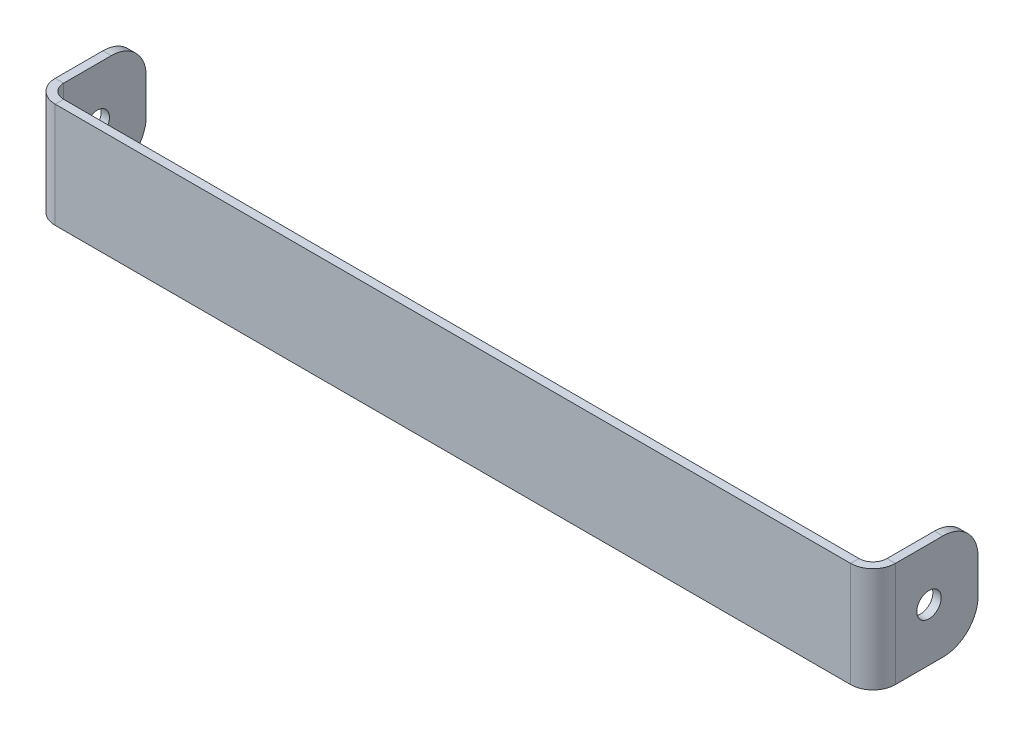
ISO-10303-21;
HEADER;
FILE_DESCRIPTION(('STEP AP214'),'2;1');
FILE_NAME('part.step','',(''),(''),'','','');
FILE_SCHEMA(('AUTOMOTIVE_DESIGN { 1 0 10303 214 1 1 1 1 }'));
ENDSEC;
DATA;
#1=APPLICATION_CONTEXT('core data for automotive mechanical design processes');
#2=APPLICATION_PROTOCOL_DEFINITION('international standard','automotive_design',2000,#1);
#3=PRODUCT_CONTEXT('',#1,'mechanical');
#4=PRODUCT('Part','Part','',(#3));
#5=PRODUCT_RELATED_PRODUCT_CATEGORY('part','',(#4));
#6=PRODUCT_DEFINITION_FORMATION('','',#4);
#7=PRODUCT_DEFINITION_CONTEXT('part definition',#1,'design');
#8=PRODUCT_DEFINITION('design','',#6,#7);
#9=PRODUCT_DEFINITION_SHAPE('','',#8);
#10=(LENGTH_UNIT() NAMED_UNIT(*) SI_UNIT(.MILLI.,.METRE.));
#11=(NAMED_UNIT(*) PLANE_ANGLE_UNIT() SI_UNIT($,.RADIAN.));
#12=(NAMED_UNIT(*) SI_UNIT($,.STERADIAN.) SOLID_ANGLE_UNIT());
#13=UNCERTAINTY_MEASURE_WITH_UNIT(LENGTH_MEASURE(1.E-05),#10,'distance_accuracy_value','');
#14=(GEOMETRIC_REPRESENTATION_CONTEXT(3) GLOBAL_UNCERTAINTY_ASSIGNED_CONTEXT((#13)) GLOBAL_UNIT_ASSIGNED_CONTEXT((#10,
#11,#12)) REPRESENTATION_CONTEXT('',''));
#15=CARTESIAN_POINT('',(0.,0.,0.));
#16=DIRECTION('',(0.,0.,1.));
#17=DIRECTION('',(1.,0.,0.));
#18=AXIS2_PLACEMENT_3D('',#15,#16,#17);
#19=CARTESIAN_POINT('',(120.,0.,3.66219024766989E-13));
#20=DIRECTION('',(-1.,0.,0.));
#21=DIRECTION('',(0.,0.,1.));
#22=AXIS2_PLACEMENT_3D('',#19,#20,#21);
#23=PLANE('',#22);
#24=DIRECTION('',(0.,1.,0.));
#25=VECTOR('',#24,1.);
#26=CARTESIAN_POINT('',(120.,0.,-15.));
#27=LINE('',#26,#25);
#28=CARTESIAN_POINT('',(120.,5.,-15.));
#29=VERTEX_POINT('',#28);
#30=CARTESIAN_POINT('',(120.,10.,-15.));
#31=VERTEX_POINT('',#30);
#32=EDGE_CURVE('E262',#29,#31,#27,.T.);
#33=ORIENTED_EDGE('',*,*,#32,.T.);
#34=CARTESIAN_POINT('',(120.,10.,-10.));
#35=DIRECTION('',(-1.,0.,0.));
#36=DIRECTION('',(0.,0.,1.));
#37=AXIS2_PLACEMENT_3D('',#34,#35,#36);
#38=CIRCLE('',#37,5.);
#39=CARTESIAN_POINT('',(120.,15.,-10.));
#40=VERTEX_POINT('',#39);
#41=EDGE_CURVE('E331',#31,#40,#38,.F.);
#42=ORIENTED_EDGE('',*,*,#41,.T.);
#43=DIRECTION('',(0.,0.,1.));
#44=VECTOR('',#43,1.);
#45=CARTESIAN_POINT('',(120.,15.,3.66219024766989E-13));
#46=LINE('',#45,#44);
#47=CARTESIAN_POINT('',(120.,15.,-3.19999999999999));
#48=VERTEX_POINT('',#47);
#49=EDGE_CURVE('E259',#40,#48,#46,.T.);
#50=ORIENTED_EDGE('',*,*,#49,.T.);
#51=DIRECTION('',(0.,-1.,0.));
#52=VECTOR('',#51,1.);
#53=CARTESIAN_POINT('',(120.,15.,-3.19999999999999));
#54=LINE('',#53,#52);
#55=CARTESIAN_POINT('',(120.,0.,-3.19999999999999));
#56=VERTEX_POINT('',#55);
#57=EDGE_CURVE('E276',#56,#48,#54,.F.);
#58=ORIENTED_EDGE('',*,*,#57,.F.);
#59=DIRECTION('',(0.,0.,-1.));
#60=VECTOR('',#59,1.);
#61=CARTESIAN_POINT('',(120.,0.,3.66219024766989E-13));
#62=LINE('',#61,#60);
#63=CARTESIAN_POINT('',(120.,0.,-10.));
#64=VERTEX_POINT('',#63);
#65=EDGE_CURVE('E265',#56,#64,#62,.T.);
#66=ORIENTED_EDGE('',*,*,#65,.T.);
#67=CARTESIAN_POINT('',(120.,5.,-10.));
#68=DIRECTION('',(-1.,0.,0.));
#69=DIRECTION('',(0.,0.,1.));
#70=AXIS2_PLACEMENT_3D('',#67,#68,#69);
#71=CIRCLE('',#70,5.);
#72=EDGE_CURVE('E329',#64,#29,#71,.F.);
#73=ORIENTED_EDGE('',*,*,#72,.T.);
#74=EDGE_LOOP('',(#33,#42,#50,#58,#66,#73));
#75=FACE_BOUND('',#74,.T.);
#76=CARTESIAN_POINT('',(120.,7.5,-8.));
#77=DIRECTION('',(1.,0.,0.));
#78=DIRECTION('',(0.,0.,-1.));
#79=AXIS2_PLACEMENT_3D('',#76,#77,#78);
#80=CIRCLE('',#79,1.75);
#81=CARTESIAN_POINT('',(120.,7.5,-9.75));
#82=VERTEX_POINT('',#81);
#83=EDGE_CURVE('E711',#82,#82,#80,.T.);
#84=ORIENTED_EDGE('',*,*,#83,.F.);
#85=EDGE_LOOP('',(#84));
#86=FACE_BOUND('',#85,.T.);
#87=ADVANCED_FACE('F82',(#75,#86),#23,.F.);
#88=CARTESIAN_POINT('',(0.,0.,-1.2));
#89=DIRECTION('',(0.,0.,-1.));
#90=DIRECTION('',(-1.,0.,0.));
#91=AXIS2_PLACEMENT_3D('',#88,#89,#90);
#92=PLANE('',#91);
#93=DIRECTION('',(1.,0.,0.));
#94=VECTOR('',#93,1.);
#95=CARTESIAN_POINT('',(0.,0.,-1.2));
#96=LINE('',#95,#94);
#97=CARTESIAN_POINT('',(3.19999999999999,0.,-1.2));
#98=VERTEX_POINT('',#97);
#99=CARTESIAN_POINT('',(116.8,0.,-1.2));
#100=VERTEX_POINT('',#99);
#101=EDGE_CURVE('E308',#98,#100,#96,.T.);
#102=ORIENTED_EDGE('',*,*,#101,.F.);
#103=DIRECTION('',(0.,1.,0.));
#104=VECTOR('',#103,1.);
#105=CARTESIAN_POINT('',(3.19999999999999,15.,-1.2));
#106=LINE('',#105,#104);
#107=CARTESIAN_POINT('',(3.19999999999999,15.,-1.2));
#108=VERTEX_POINT('',#107);
#109=EDGE_CURVE('E249',#108,#98,#106,.F.);
#110=ORIENTED_EDGE('',*,*,#109,.F.);
#111=DIRECTION('',(-1.,0.,0.));
#112=VECTOR('',#111,1.);
#113=CARTESIAN_POINT('',(0.,15.,-1.2));
#114=LINE('',#113,#112);
#115=CARTESIAN_POINT('',(116.8,15.,-1.2));
#116=VERTEX_POINT('',#115);
#117=EDGE_CURVE('E310',#116,#108,#114,.T.);
#118=ORIENTED_EDGE('',*,*,#117,.F.);
#119=DIRECTION('',(0.,-1.,0.));
#120=VECTOR('',#119,1.);
#121=CARTESIAN_POINT('',(116.8,0.,-1.2));
#122=LINE('',#121,#120);
#123=EDGE_CURVE('E298',#100,#116,#122,.F.);
#124=ORIENTED_EDGE('',*,*,#123,.F.);
#125=EDGE_LOOP('',(#102,#110,#118,#124));
#126=FACE_BOUND('',#125,.T.);
#127=ADVANCED_FACE('F373',(#126),#92,.T.);
#128=CARTESIAN_POINT('',(0.,0.,0.));
#129=DIRECTION('',(0.,0.,-1.));
#130=DIRECTION('',(-1.,0.,0.));
#131=AXIS2_PLACEMENT_3D('',#128,#129,#130);
#132=PLANE('',#131);
#133=DIRECTION('',(0.,1.,0.));
#134=VECTOR('',#133,1.);
#135=CARTESIAN_POINT('',(3.19999999999999,15.,0.));
#136=LINE('',#135,#134);
#137=CARTESIAN_POINT('',(3.19999999999999,15.,0.));
#138=VERTEX_POINT('',#137);
#139=CARTESIAN_POINT('',(3.19999999999999,0.,0.));
#140=VERTEX_POINT('',#139);
#141=EDGE_CURVE('E205',#138,#140,#136,.F.);
#142=ORIENTED_EDGE('',*,*,#141,.T.);
#143=DIRECTION('',(1.,0.,0.));
#144=VECTOR('',#143,1.);
#145=CARTESIAN_POINT('',(0.,0.,0.));
#146=LINE('',#145,#144);
#147=CARTESIAN_POINT('',(116.8,0.,0.));
#148=VERTEX_POINT('',#147);
#149=EDGE_CURVE('E306',#140,#148,#146,.T.);
#150=ORIENTED_EDGE('',*,*,#149,.T.);
#151=DIRECTION('',(0.,-1.,0.));
#152=VECTOR('',#151,1.);
#153=CARTESIAN_POINT('',(116.8,0.,0.));
#154=LINE('',#153,#152);
#155=CARTESIAN_POINT('',(116.8,15.,0.));
#156=VERTEX_POINT('',#155);
#157=EDGE_CURVE('E286',#148,#156,#154,.F.);
#158=ORIENTED_EDGE('',*,*,#157,.T.);
#159=DIRECTION('',(-1.,0.,0.));
#160=VECTOR('',#159,1.);
#161=CARTESIAN_POINT('',(0.,15.,0.));
#162=LINE('',#161,#160);
#163=EDGE_CURVE('E311',#156,#138,#162,.T.);
#164=ORIENTED_EDGE('',*,*,#163,.T.);
#165=EDGE_LOOP('',(#142,#150,#158,#164));
#166=FACE_BOUND('',#165,.T.);
#167=ADVANCED_FACE('F420',(#166),#132,.F.);
#168=CARTESIAN_POINT('',(0.,15.,-1.2));
#169=DIRECTION('',(0.,1.,0.));
#170=DIRECTION('',(0.,0.,1.));
#171=AXIS2_PLACEMENT_3D('',#168,#169,#170);
#172=PLANE('',#171);
#173=ORIENTED_EDGE('',*,*,#117,.T.);
#174=DIRECTION('',(0.,0.,1.));
#175=VECTOR('',#174,1.);
#176=CARTESIAN_POINT('',(3.19999999999999,15.,-1.2));
#177=LINE('',#176,#175);
#178=EDGE_CURVE('E245',#108,#138,#177,.T.);
#179=ORIENTED_EDGE('',*,*,#178,.T.);
#180=ORIENTED_EDGE('',*,*,#163,.F.);
#181=DIRECTION('',(0.,0.,1.));
#182=VECTOR('',#181,1.);
#183=CARTESIAN_POINT('',(116.8,15.,-1.2));
#184=LINE('',#183,#182);
#185=EDGE_CURVE('E303',#116,#156,#184,.T.);
#186=ORIENTED_EDGE('',*,*,#185,.F.);
#187=EDGE_LOOP('',(#173,#179,#180,#186));
#188=FACE_BOUND('',#187,.T.);
#189=ADVANCED_FACE('F422',(#188),#172,.T.);
#190=CARTESIAN_POINT('',(0.,0.,-1.2));
#191=DIRECTION('',(0.,-1.,0.));
#192=DIRECTION('',(0.,0.,-1.));
#193=AXIS2_PLACEMENT_3D('',#190,#191,#192);
#194=PLANE('',#193);
#195=DIRECTION('',(0.,0.,1.));
#196=VECTOR('',#195,1.);
#197=CARTESIAN_POINT('',(3.19999999999999,0.,-1.2));
#198=LINE('',#197,#196);
#199=EDGE_CURVE('E253',#98,#140,#198,.T.);
#200=ORIENTED_EDGE('',*,*,#199,.F.);
#201=ORIENTED_EDGE('',*,*,#101,.T.);
#202=DIRECTION('',(0.,0.,1.));
#203=VECTOR('',#202,1.);
#204=CARTESIAN_POINT('',(116.8,0.,-1.2));
#205=LINE('',#204,#203);
#206=EDGE_CURVE('E292',#100,#148,#205,.T.);
#207=ORIENTED_EDGE('',*,*,#206,.T.);
#208=ORIENTED_EDGE('',*,*,#149,.F.);
#209=EDGE_LOOP('',(#200,#201,#207,#208));
#210=FACE_BOUND('',#209,.T.);
#211=ADVANCED_FACE('F370',(#210),#194,.T.);
#212=CARTESIAN_POINT('',(116.8,15.,-3.2));
#213=DIRECTION('',(0.,1.,0.));
#214=DIRECTION('',(0.,0.,1.));
#215=AXIS2_PLACEMENT_3D('',#212,#213,#214);
#216=PLANE('',#215);
#217=DIRECTION('',(-1.,0.,0.));
#218=VECTOR('',#217,1.);
#219=CARTESIAN_POINT('',(120.,15.,-3.19999999999999));
#220=LINE('',#219,#218);
#221=CARTESIAN_POINT('',(118.8,15.,-3.19999999999999));
#222=VERTEX_POINT('',#221);
#223=EDGE_CURVE('E256',#222,#48,#220,.F.);
#224=ORIENTED_EDGE('',*,*,#223,.F.);
#225=CARTESIAN_POINT('',(116.8,15.,-3.2));
#226=DIRECTION('',(0.,-1.,0.));
#227=DIRECTION('',(0.,0.,-1.));
#228=AXIS2_PLACEMENT_3D('',#225,#226,#227);
#229=CIRCLE('',#228,2.);
#230=EDGE_CURVE('E295',#116,#222,#229,.F.);
#231=ORIENTED_EDGE('',*,*,#230,.F.);
#232=ORIENTED_EDGE('',*,*,#185,.T.);
#233=CARTESIAN_POINT('',(116.8,15.,-3.2));
#234=DIRECTION('',(0.,-1.,0.));
#235=DIRECTION('',(0.,0.,-1.));
#236=AXIS2_PLACEMENT_3D('',#233,#234,#235);
#237=CIRCLE('',#236,3.2);
#238=EDGE_CURVE('E288',#156,#48,#237,.F.);
#239=ORIENTED_EDGE('',*,*,#238,.T.);
#240=EDGE_LOOP('',(#224,#231,#232,#239));
#241=FACE_BOUND('',#240,.T.);
#242=ADVANCED_FACE('F413',(#241),#216,.T.);
#243=CARTESIAN_POINT('',(116.8,0.,-3.2));
#244=DIRECTION('',(0.,1.,0.));
#245=DIRECTION('',(0.,0.,1.));
#246=AXIS2_PLACEMENT_3D('',#243,#244,#245);
#247=PLANE('',#246);
#248=CARTESIAN_POINT('',(116.8,0.,-3.2));
#249=DIRECTION('',(0.,-1.,0.));
#250=DIRECTION('',(0.,0.,-1.));
#251=AXIS2_PLACEMENT_3D('',#248,#249,#250);
#252=CIRCLE('',#251,2.);
#253=CARTESIAN_POINT('',(118.8,0.,-3.19999999999999));
#254=VERTEX_POINT('',#253);
#255=EDGE_CURVE('E261',#254,#100,#252,.T.);
#256=ORIENTED_EDGE('',*,*,#255,.F.);
#257=DIRECTION('',(-1.,0.,0.));
#258=VECTOR('',#257,1.);
#259=CARTESIAN_POINT('',(118.8,0.,-3.19999999999999));
#260=LINE('',#259,#258);
#261=EDGE_CURVE('E279',#254,#56,#260,.F.);
#262=ORIENTED_EDGE('',*,*,#261,.T.);
#263=CARTESIAN_POINT('',(116.8,0.,-3.2));
#264=DIRECTION('',(0.,-1.,0.));
#265=DIRECTION('',(0.,0.,-1.));
#266=AXIS2_PLACEMENT_3D('',#263,#264,#265);
#267=CIRCLE('',#266,3.2);
#268=EDGE_CURVE('E289',#56,#148,#267,.T.);
#269=ORIENTED_EDGE('',*,*,#268,.T.);
#270=ORIENTED_EDGE('',*,*,#206,.F.);
#271=EDGE_LOOP('',(#256,#262,#269,#270));
#272=FACE_BOUND('',#271,.T.);
#273=ADVANCED_FACE('F380',(#272),#247,.F.);
#274=CARTESIAN_POINT('',(116.8,0.,-3.2));
#275=DIRECTION('',(0.,-1.,0.));
#276=DIRECTION('',(1.,0.,0.));
#277=AXIS2_PLACEMENT_3D('',#274,#275,#276);
#278=CYLINDRICAL_SURFACE('',#277,3.2);
#279=ORIENTED_EDGE('',*,*,#157,.F.);
#280=ORIENTED_EDGE('',*,*,#268,.F.);
#281=ORIENTED_EDGE('',*,*,#57,.T.);
#282=ORIENTED_EDGE('',*,*,#238,.F.);
#283=EDGE_LOOP('',(#279,#280,#281,#282));
#284=FACE_BOUND('',#283,.T.);
#285=ADVANCED_FACE('F417',(#284),#278,.T.);
#286=CARTESIAN_POINT('',(116.8,0.,-3.2));
#287=DIRECTION('',(0.,-1.,0.));
#288=DIRECTION('',(1.,0.,0.));
#289=AXIS2_PLACEMENT_3D('',#286,#287,#288);
#290=CYLINDRICAL_SURFACE('',#289,2.);
#291=ORIENTED_EDGE('',*,*,#123,.T.);
#292=ORIENTED_EDGE('',*,*,#230,.T.);
#293=DIRECTION('',(0.,-1.,0.));
#294=VECTOR('',#293,1.);
#295=CARTESIAN_POINT('',(118.8,15.,-3.19999999999999));
#296=LINE('',#295,#294);
#297=EDGE_CURVE('E282',#222,#254,#296,.T.);
#298=ORIENTED_EDGE('',*,*,#297,.T.);
#299=ORIENTED_EDGE('',*,*,#255,.T.);
#300=EDGE_LOOP('',(#291,#292,#298,#299));
#301=FACE_BOUND('',#300,.T.);
#302=ADVANCED_FACE('F382',(#301),#290,.F.);
#303=CARTESIAN_POINT('',(120.,0.,-15.));
#304=DIRECTION('',(0.,1.,0.));
#305=DIRECTION('',(0.,0.,1.));
#306=AXIS2_PLACEMENT_3D('',#303,#304,#305);
#307=PLANE('',#306);
#308=DIRECTION('',(0.,0.,1.));
#309=VECTOR('',#308,1.);
#310=CARTESIAN_POINT('',(118.8,0.,-15.));
#311=LINE('',#310,#309);
#312=CARTESIAN_POINT('',(118.8,0.,-10.));
#313=VERTEX_POINT('',#312);
#314=EDGE_CURVE('E273',#254,#313,#311,.F.);
#315=ORIENTED_EDGE('',*,*,#314,.T.);
#316=DIRECTION('',(-1.,0.,0.));
#317=VECTOR('',#316,1.);
#318=CARTESIAN_POINT('',(120.,0.,-10.));
#319=LINE('',#318,#317);
#320=EDGE_CURVE('E333',#313,#64,#319,.F.);
#321=ORIENTED_EDGE('',*,*,#320,.T.);
#322=ORIENTED_EDGE('',*,*,#65,.F.);
#323=ORIENTED_EDGE('',*,*,#261,.F.);
#324=EDGE_LOOP('',(#315,#321,#322,#323));
#325=FACE_BOUND('',#324,.T.);
#326=ADVANCED_FACE('F391',(#325),#307,.F.);
#327=CARTESIAN_POINT('',(120.,15.,-1.2));
#328=DIRECTION('',(0.,-1.,0.));
#329=DIRECTION('',(0.,0.,-1.));
#330=AXIS2_PLACEMENT_3D('',#327,#328,#329);
#331=PLANE('',#330);
#332=ORIENTED_EDGE('',*,*,#49,.F.);
#333=DIRECTION('',(-1.,0.,0.));
#334=VECTOR('',#333,1.);
#335=CARTESIAN_POINT('',(120.,15.,-10.));
#336=LINE('',#335,#334);
#337=CARTESIAN_POINT('',(118.8,15.,-10.));
#338=VERTEX_POINT('',#337);
#339=EDGE_CURVE('E314',#40,#338,#336,.T.);
#340=ORIENTED_EDGE('',*,*,#339,.T.);
#341=DIRECTION('',(0.,0.,-1.));
#342=VECTOR('',#341,1.);
#343=CARTESIAN_POINT('',(118.8,15.,-1.2));
#344=LINE('',#343,#342);
#345=EDGE_CURVE('E268',#338,#222,#344,.F.);
#346=ORIENTED_EDGE('',*,*,#345,.T.);
#347=ORIENTED_EDGE('',*,*,#223,.T.);
#348=EDGE_LOOP('',(#332,#340,#346,#347));
#349=FACE_BOUND('',#348,.T.);
#350=ADVANCED_FACE('F410',(#349),#331,.F.);
#351=CARTESIAN_POINT('',(118.8,0.,3.62029247160377E-13));
#352=DIRECTION('',(-1.,0.,0.));
#353=DIRECTION('',(0.,0.,1.));
#354=AXIS2_PLACEMENT_3D('',#351,#352,#353);
#355=PLANE('',#354);
#356=CARTESIAN_POINT('',(118.8,7.5,-8.));
#357=DIRECTION('',(-1.,0.,0.));
#358=DIRECTION('',(0.,0.,1.));
#359=AXIS2_PLACEMENT_3D('',#356,#357,#358);
#360=CIRCLE('',#359,1.75);
#361=CARTESIAN_POINT('',(118.8,7.5,-6.25));
#362=VERTEX_POINT('',#361);
#363=EDGE_CURVE('E242',#362,#362,#360,.T.);
#364=ORIENTED_EDGE('',*,*,#363,.F.);
#365=EDGE_LOOP('',(#364));
#366=FACE_BOUND('',#365,.T.);
#367=ORIENTED_EDGE('',*,*,#345,.F.);
#368=CARTESIAN_POINT('',(118.8,10.,-10.));
#369=DIRECTION('',(-1.,0.,0.));
#370=DIRECTION('',(0.,0.,1.));
#371=AXIS2_PLACEMENT_3D('',#368,#369,#370);
#372=CIRCLE('',#371,5.);
#373=CARTESIAN_POINT('',(118.8,10.,-15.));
#374=VERTEX_POINT('',#373);
#375=EDGE_CURVE('E322',#338,#374,#372,.T.);
#376=ORIENTED_EDGE('',*,*,#375,.T.);
#377=DIRECTION('',(0.,-1.,0.));
#378=VECTOR('',#377,1.);
#379=CARTESIAN_POINT('',(118.8,15.,-15.));
#380=LINE('',#379,#378);
#381=CARTESIAN_POINT('',(118.8,5.,-15.));
#382=VERTEX_POINT('',#381);
#383=EDGE_CURVE('E270',#382,#374,#380,.F.);
#384=ORIENTED_EDGE('',*,*,#383,.F.);
#385=CARTESIAN_POINT('',(118.8,5.,-10.));
#386=DIRECTION('',(-1.,0.,0.));
#387=DIRECTION('',(0.,0.,1.));
#388=AXIS2_PLACEMENT_3D('',#385,#386,#387);
#389=CIRCLE('',#388,5.);
#390=EDGE_CURVE('E320',#382,#313,#389,.T.);
#391=ORIENTED_EDGE('',*,*,#390,.T.);
#392=ORIENTED_EDGE('',*,*,#314,.F.);
#393=ORIENTED_EDGE('',*,*,#297,.F.);
#394=EDGE_LOOP('',(#367,#376,#384,#391,#392,#393));
#395=FACE_BOUND('',#394,.T.);
#396=ADVANCED_FACE('F387',(#366,#395),#355,.T.);
#397=CARTESIAN_POINT('',(120.,15.,-15.));
#398=DIRECTION('',(0.,0.,1.));
#399=DIRECTION('',(1.,0.,0.));
#400=AXIS2_PLACEMENT_3D('',#397,#398,#399);
#401=PLANE('',#400);
#402=ORIENTED_EDGE('',*,*,#383,.T.);
#403=DIRECTION('',(-1.,0.,0.));
#404=VECTOR('',#403,1.);
#405=CARTESIAN_POINT('',(120.,10.,-15.));
#406=LINE('',#405,#404);
#407=EDGE_CURVE('E327',#374,#31,#406,.F.);
#408=ORIENTED_EDGE('',*,*,#407,.T.);
#409=ORIENTED_EDGE('',*,*,#32,.F.);
#410=DIRECTION('',(-1.,0.,0.));
#411=VECTOR('',#410,1.);
#412=CARTESIAN_POINT('',(120.,5.,-15.));
#413=LINE('',#412,#411);
#414=EDGE_CURVE('E324',#29,#382,#413,.T.);
#415=ORIENTED_EDGE('',*,*,#414,.T.);
#416=EDGE_LOOP('',(#402,#408,#409,#415));
#417=FACE_BOUND('',#416,.T.);
#418=ADVANCED_FACE('F403',(#417),#401,.F.);
#419=CARTESIAN_POINT('',(3.19999999999999,0.,-3.2));
#420=DIRECTION('',(0.,-1.,0.));
#421=DIRECTION('',(0.,0.,-1.));
#422=AXIS2_PLACEMENT_3D('',#419,#420,#421);
#423=PLANE('',#422);
#424=DIRECTION('',(1.,0.,0.));
#425=VECTOR('',#424,1.);
#426=CARTESIAN_POINT('',(0.,0.,-3.19999999999999));
#427=LINE('',#426,#425);
#428=CARTESIAN_POINT('',(1.19999999999999,0.,-3.19999999999999));
#429=VERTEX_POINT('',#428);
#430=CARTESIAN_POINT('',(0.,0.,-3.19999999999999));
#431=VERTEX_POINT('',#430);
#432=EDGE_CURVE('E239',#429,#431,#427,.F.);
#433=ORIENTED_EDGE('',*,*,#432,.F.);
#434=CARTESIAN_POINT('',(3.19999999999999,0.,-3.2));
#435=DIRECTION('',(0.,1.,0.));
#436=DIRECTION('',(0.,0.,1.));
#437=AXIS2_PLACEMENT_3D('',#434,#435,#436);
#438=CIRCLE('',#437,2.);
#439=EDGE_CURVE('E208',#98,#429,#438,.F.);
#440=ORIENTED_EDGE('',*,*,#439,.F.);
#441=ORIENTED_EDGE('',*,*,#199,.T.);
#442=CARTESIAN_POINT('',(3.19999999999999,0.,-3.2));
#443=DIRECTION('',(0.,1.,0.));
#444=DIRECTION('',(0.,0.,1.));
#445=AXIS2_PLACEMENT_3D('',#442,#443,#444);
#446=CIRCLE('',#445,3.2);
#447=EDGE_CURVE('E244',#140,#431,#446,.F.);
#448=ORIENTED_EDGE('',*,*,#447,.T.);
#449=EDGE_LOOP('',(#433,#440,#441,#448));
#450=FACE_BOUND('',#449,.T.);
#451=ADVANCED_FACE('F366',(#450),#423,.T.);
#452=CARTESIAN_POINT('',(3.19999999999999,15.,-3.2));
#453=DIRECTION('',(0.,-1.,0.));
#454=DIRECTION('',(0.,0.,-1.));
#455=AXIS2_PLACEMENT_3D('',#452,#453,#454);
#456=PLANE('',#455);
#457=CARTESIAN_POINT('',(3.19999999999999,15.,-3.2));
#458=DIRECTION('',(0.,1.,0.));
#459=DIRECTION('',(0.,0.,1.));
#460=AXIS2_PLACEMENT_3D('',#457,#458,#459);
#461=CIRCLE('',#460,2.);
#462=CARTESIAN_POINT('',(1.19999999999999,15.,-3.19999999999999));
#463=VERTEX_POINT('',#462);
#464=EDGE_CURVE('E215',#463,#108,#461,.T.);
#465=ORIENTED_EDGE('',*,*,#464,.F.);
#466=DIRECTION('',(1.,0.,0.));
#467=VECTOR('',#466,1.);
#468=CARTESIAN_POINT('',(1.19999999999999,15.,-3.19999999999999));
#469=LINE('',#468,#467);
#470=CARTESIAN_POINT('',(0.,15.,-3.19999999999999));
#471=VERTEX_POINT('',#470);
#472=EDGE_CURVE('E212',#463,#471,#469,.F.);
#473=ORIENTED_EDGE('',*,*,#472,.T.);
#474=CARTESIAN_POINT('',(3.19999999999999,15.,-3.2));
#475=DIRECTION('',(0.,1.,0.));
#476=DIRECTION('',(0.,0.,1.));
#477=AXIS2_PLACEMENT_3D('',#474,#475,#476);
#478=CIRCLE('',#477,3.2);
#479=EDGE_CURVE('E198',#471,#138,#478,.T.);
#480=ORIENTED_EDGE('',*,*,#479,.T.);
#481=ORIENTED_EDGE('',*,*,#178,.F.);
#482=EDGE_LOOP('',(#465,#473,#480,#481));
#483=FACE_BOUND('',#482,.T.);
#484=ADVANCED_FACE('F213',(#483),#456,.F.);
#485=CARTESIAN_POINT('',(3.19999999999999,15.,-3.2));
#486=DIRECTION('',(0.,1.,0.));
#487=DIRECTION('',(-1.,0.,0.));
#488=AXIS2_PLACEMENT_3D('',#485,#486,#487);
#489=CYLINDRICAL_SURFACE('',#488,3.2);
#490=ORIENTED_EDGE('',*,*,#141,.F.);
#491=ORIENTED_EDGE('',*,*,#479,.F.);
#492=DIRECTION('',(0.,1.,0.));
#493=VECTOR('',#492,1.);
#494=CARTESIAN_POINT('',(0.,0.,-3.19999999999999));
#495=LINE('',#494,#493);
#496=EDGE_CURVE('E203',#471,#431,#495,.F.);
#497=ORIENTED_EDGE('',*,*,#496,.T.);
#498=ORIENTED_EDGE('',*,*,#447,.F.);
#499=EDGE_LOOP('',(#490,#491,#497,#498));
#500=FACE_BOUND('',#499,.T.);
#501=ADVANCED_FACE('F200',(#500),#489,.T.);
#502=CARTESIAN_POINT('',(3.19999999999999,15.,-3.2));
#503=DIRECTION('',(0.,1.,0.));
#504=DIRECTION('',(-1.,0.,0.));
#505=AXIS2_PLACEMENT_3D('',#502,#503,#504);
#506=CYLINDRICAL_SURFACE('',#505,2.);
#507=ORIENTED_EDGE('',*,*,#109,.T.);
#508=ORIENTED_EDGE('',*,*,#439,.T.);
#509=DIRECTION('',(0.,1.,0.));
#510=VECTOR('',#509,1.);
#511=CARTESIAN_POINT('',(1.19999999999999,0.,-3.19999999999999));
#512=LINE('',#511,#510);
#513=EDGE_CURVE('E217',#429,#463,#512,.T.);
#514=ORIENTED_EDGE('',*,*,#513,.T.);
#515=ORIENTED_EDGE('',*,*,#464,.T.);
#516=EDGE_LOOP('',(#507,#508,#514,#515));
#517=FACE_BOUND('',#516,.T.);
#518=ADVANCED_FACE('F363',(#517),#506,.F.);
#519=CARTESIAN_POINT('',(0.,15.,-15.));
#520=DIRECTION('',(0.,-1.,0.));
#521=DIRECTION('',(0.,0.,-1.));
#522=AXIS2_PLACEMENT_3D('',#519,#520,#521);
#523=PLANE('',#522);
#524=DIRECTION('',(0.,0.,1.));
#525=VECTOR('',#524,1.);
#526=CARTESIAN_POINT('',(1.19999999999995,15.,-15.));
#527=LINE('',#526,#525);
#528=CARTESIAN_POINT('',(1.19999999999997,15.,-10.));
#529=VERTEX_POINT('',#528);
#530=EDGE_CURVE('E225',#463,#529,#527,.F.);
#531=ORIENTED_EDGE('',*,*,#530,.T.);
#532=DIRECTION('',(1.,0.,0.));
#533=VECTOR('',#532,1.);
#534=CARTESIAN_POINT('',(0.,15.,-10.));
#535=LINE('',#534,#533);
#536=CARTESIAN_POINT('',(0.,15.,-10.));
#537=VERTEX_POINT('',#536);
#538=EDGE_CURVE('E13',#529,#537,#535,.F.);
#539=ORIENTED_EDGE('',*,*,#538,.T.);
#540=DIRECTION('',(0.,0.,-1.));
#541=VECTOR('',#540,1.);
#542=CARTESIAN_POINT('',(0.,15.,0.));
#543=LINE('',#542,#541);
#544=EDGE_CURVE('E221',#471,#537,#543,.T.);
#545=ORIENTED_EDGE('',*,*,#544,.F.);
#546=ORIENTED_EDGE('',*,*,#472,.F.);
#547=EDGE_LOOP('',(#531,#539,#545,#546));
#548=FACE_BOUND('',#547,.T.);
#549=ADVANCED_FACE('F227',(#548),#523,.F.);
#550=CARTESIAN_POINT('',(0.,0.,-1.2));
#551=DIRECTION('',(0.,1.,0.));
#552=DIRECTION('',(0.,0.,1.));
#553=AXIS2_PLACEMENT_3D('',#550,#551,#552);
#554=PLANE('',#553);
#555=DIRECTION('',(0.,0.,1.));
#556=VECTOR('',#555,1.);
#557=CARTESIAN_POINT('',(0.,0.,0.));
#558=LINE('',#557,#556);
#559=CARTESIAN_POINT('',(0.,0.,-10.));
#560=VERTEX_POINT('',#559);
#561=EDGE_CURVE('E224',#560,#431,#558,.T.);
#562=ORIENTED_EDGE('',*,*,#561,.F.);
#563=DIRECTION('',(1.,0.,0.));
#564=VECTOR('',#563,1.);
#565=CARTESIAN_POINT('',(0.,0.,-10.));
#566=LINE('',#565,#564);
#567=CARTESIAN_POINT('',(1.19999999999997,0.,-10.));
#568=VERTEX_POINT('',#567);
#569=EDGE_CURVE('E335',#560,#568,#566,.T.);
#570=ORIENTED_EDGE('',*,*,#569,.T.);
#571=DIRECTION('',(0.,0.,-1.));
#572=VECTOR('',#571,1.);
#573=CARTESIAN_POINT('',(1.2,0.,-1.2));
#574=LINE('',#573,#572);
#575=EDGE_CURVE('E229',#568,#429,#574,.F.);
#576=ORIENTED_EDGE('',*,*,#575,.T.);
#577=ORIENTED_EDGE('',*,*,#432,.T.);
#578=EDGE_LOOP('',(#562,#570,#576,#577));
#579=FACE_BOUND('',#578,.T.);
#580=ADVANCED_FACE('F351',(#579),#554,.F.);
#581=CARTESIAN_POINT('',(0.,0.,0.));
#582=DIRECTION('',(1.,0.,0.));
#583=DIRECTION('',(0.,0.,-1.));
#584=AXIS2_PLACEMENT_3D('',#581,#582,#583);
#585=PLANE('',#584);
#586=CARTESIAN_POINT('',(0.,7.5,-7.99999999999959));
#587=DIRECTION('',(-1.,0.,0.));
#588=DIRECTION('',(0.,0.,1.));
#589=AXIS2_PLACEMENT_3D('',#586,#587,#588);
#590=CIRCLE('',#589,1.74999999999999);
#591=CARTESIAN_POINT('',(0.,7.5,-6.2499999999996));
#592=VERTEX_POINT('',#591);
#593=EDGE_CURVE('E707',#592,#592,#590,.T.);
#594=ORIENTED_EDGE('',*,*,#593,.F.);
#595=EDGE_LOOP('',(#594));
#596=FACE_BOUND('',#595,.T.);
#597=DIRECTION('',(0.,-1.,0.));
#598=VECTOR('',#597,1.);
#599=CARTESIAN_POINT('',(0.,0.,-15.));
#600=LINE('',#599,#598);
#601=CARTESIAN_POINT('',(0.,10.,-15.));
#602=VERTEX_POINT('',#601);
#603=CARTESIAN_POINT('',(0.,5.,-15.));
#604=VERTEX_POINT('',#603);
#605=EDGE_CURVE('E228',#602,#604,#600,.T.);
#606=ORIENTED_EDGE('',*,*,#605,.T.);
#607=CARTESIAN_POINT('',(0.,5.,-10.));
#608=DIRECTION('',(1.,0.,0.));
#609=DIRECTION('',(0.,0.,-1.));
#610=AXIS2_PLACEMENT_3D('',#607,#608,#609);
#611=CIRCLE('',#610,5.);
#612=EDGE_CURVE('E90',#604,#560,#611,.F.);
#613=ORIENTED_EDGE('',*,*,#612,.T.);
#614=ORIENTED_EDGE('',*,*,#561,.T.);
#615=ORIENTED_EDGE('',*,*,#496,.F.);
#616=ORIENTED_EDGE('',*,*,#544,.T.);
#617=CARTESIAN_POINT('',(0.,10.,-10.));
#618=DIRECTION('',(1.,0.,0.));
#619=DIRECTION('',(0.,0.,-1.));
#620=AXIS2_PLACEMENT_3D('',#617,#618,#619);
#621=CIRCLE('',#620,5.);
#622=EDGE_CURVE('E346',#537,#602,#621,.F.);
#623=ORIENTED_EDGE('',*,*,#622,.T.);
#624=EDGE_LOOP('',(#606,#613,#614,#615,#616,#623));
#625=FACE_BOUND('',#624,.T.);
#626=ADVANCED_FACE('F220',(#596,#625),#585,.F.);
#627=CARTESIAN_POINT('',(1.2,0.,0.));
#628=DIRECTION('',(1.,0.,0.));
#629=DIRECTION('',(0.,0.,-1.));
#630=AXIS2_PLACEMENT_3D('',#627,#628,#629);
#631=PLANE('',#630);
#632=CARTESIAN_POINT('',(1.19999999999998,7.5,-7.99999999999959));
#633=DIRECTION('',(1.,0.,0.));
#634=DIRECTION('',(0.,0.,-1.));
#635=AXIS2_PLACEMENT_3D('',#632,#633,#634);
#636=CIRCLE('',#635,1.74999999999999);
#637=CARTESIAN_POINT('',(1.19999999999997,7.5,-9.74999999999959));
#638=VERTEX_POINT('',#637);
#639=EDGE_CURVE('E710',#638,#638,#636,.T.);
#640=ORIENTED_EDGE('',*,*,#639,.F.);
#641=EDGE_LOOP('',(#640));
#642=FACE_BOUND('',#641,.T.);
#643=ORIENTED_EDGE('',*,*,#575,.F.);
#644=CARTESIAN_POINT('',(1.19999999999997,5.,-10.));
#645=DIRECTION('',(1.,0.,0.));
#646=DIRECTION('',(0.,0.,-1.));
#647=AXIS2_PLACEMENT_3D('',#644,#645,#646);
#648=CIRCLE('',#647,5.);
#649=CARTESIAN_POINT('',(1.19999999999995,5.,-15.));
#650=VERTEX_POINT('',#649);
#651=EDGE_CURVE('E340',#568,#650,#648,.T.);
#652=ORIENTED_EDGE('',*,*,#651,.T.);
#653=DIRECTION('',(0.,1.,0.));
#654=VECTOR('',#653,1.);
#655=CARTESIAN_POINT('',(1.19999999999995,0.,-15.));
#656=LINE('',#655,#654);
#657=CARTESIAN_POINT('',(1.19999999999995,10.,-15.));
#658=VERTEX_POINT('',#657);
#659=EDGE_CURVE('E232',#658,#650,#656,.F.);
#660=ORIENTED_EDGE('',*,*,#659,.F.);
#661=CARTESIAN_POINT('',(1.19999999999997,10.,-10.));
#662=DIRECTION('',(1.,0.,0.));
#663=DIRECTION('',(0.,0.,-1.));
#664=AXIS2_PLACEMENT_3D('',#661,#662,#663);
#665=CIRCLE('',#664,5.);
#666=EDGE_CURVE('E338',#658,#529,#665,.T.);
#667=ORIENTED_EDGE('',*,*,#666,.T.);
#668=ORIENTED_EDGE('',*,*,#530,.F.);
#669=ORIENTED_EDGE('',*,*,#513,.F.);
#670=EDGE_LOOP('',(#643,#652,#660,#667,#668,#669));
#671=FACE_BOUND('',#670,.T.);
#672=ADVANCED_FACE('F357',(#642,#671),#631,.T.);
#673=CARTESIAN_POINT('',(0.,0.,-15.));
#674=DIRECTION('',(0.,0.,1.));
#675=DIRECTION('',(1.,0.,0.));
#676=AXIS2_PLACEMENT_3D('',#673,#674,#675);
#677=PLANE('',#676);
#678=ORIENTED_EDGE('',*,*,#659,.T.);
#679=DIRECTION('',(1.,0.,0.));
#680=VECTOR('',#679,1.);
#681=CARTESIAN_POINT('',(0.,5.,-15.));
#682=LINE('',#681,#680);
#683=EDGE_CURVE('E103',#650,#604,#682,.F.);
#684=ORIENTED_EDGE('',*,*,#683,.T.);
#685=ORIENTED_EDGE('',*,*,#605,.F.);
#686=DIRECTION('',(1.,0.,0.));
#687=VECTOR('',#686,1.);
#688=CARTESIAN_POINT('',(0.,10.,-15.));
#689=LINE('',#688,#687);
#690=EDGE_CURVE('E342',#602,#658,#689,.T.);
#691=ORIENTED_EDGE('',*,*,#690,.T.);
#692=EDGE_LOOP('',(#678,#684,#685,#691));
#693=FACE_BOUND('',#692,.T.);
#694=ADVANCED_FACE('F359',(#693),#677,.F.);
#695=CARTESIAN_POINT('',(120.,10.,-10.));
#696=DIRECTION('',(-1.,0.,0.));
#697=DIRECTION('',(0.,0.,1.));
#698=AXIS2_PLACEMENT_3D('',#695,#696,#697);
#699=CYLINDRICAL_SURFACE('',#698,5.);
#700=ORIENTED_EDGE('',*,*,#41,.F.);
#701=ORIENTED_EDGE('',*,*,#407,.F.);
#702=ORIENTED_EDGE('',*,*,#375,.F.);
#703=ORIENTED_EDGE('',*,*,#339,.F.);
#704=EDGE_LOOP('',(#700,#701,#702,#703));
#705=FACE_BOUND('',#704,.T.);
#706=ADVANCED_FACE('F406',(#705),#699,.T.);
#707=CARTESIAN_POINT('',(120.,5.,-10.));
#708=DIRECTION('',(-1.,0.,0.));
#709=DIRECTION('',(0.,0.,1.));
#710=AXIS2_PLACEMENT_3D('',#707,#708,#709);
#711=CYLINDRICAL_SURFACE('',#710,5.);
#712=ORIENTED_EDGE('',*,*,#72,.F.);
#713=ORIENTED_EDGE('',*,*,#320,.F.);
#714=ORIENTED_EDGE('',*,*,#390,.F.);
#715=ORIENTED_EDGE('',*,*,#414,.F.);
#716=EDGE_LOOP('',(#712,#713,#714,#715));
#717=FACE_BOUND('',#716,.T.);
#718=ADVANCED_FACE('F395',(#717),#711,.T.);
#719=CARTESIAN_POINT('',(0.,5.,-10.));
#720=DIRECTION('',(1.,0.,0.));
#721=DIRECTION('',(0.,0.,-1.));
#722=AXIS2_PLACEMENT_3D('',#719,#720,#721);
#723=CYLINDRICAL_SURFACE('',#722,5.);
#724=ORIENTED_EDGE('',*,*,#612,.F.);
#725=ORIENTED_EDGE('',*,*,#683,.F.);
#726=ORIENTED_EDGE('',*,*,#651,.F.);
#727=ORIENTED_EDGE('',*,*,#569,.F.);
#728=EDGE_LOOP('',(#724,#725,#726,#727));
#729=FACE_BOUND('',#728,.T.);
#730=ADVANCED_FACE('F354',(#729),#723,.T.);
#731=CARTESIAN_POINT('',(0.,10.,-10.));
#732=DIRECTION('',(1.,0.,0.));
#733=DIRECTION('',(0.,0.,-1.));
#734=AXIS2_PLACEMENT_3D('',#731,#732,#733);
#735=CYLINDRICAL_SURFACE('',#734,5.);
#736=ORIENTED_EDGE('',*,*,#622,.F.);
#737=ORIENTED_EDGE('',*,*,#538,.F.);
#738=ORIENTED_EDGE('',*,*,#666,.F.);
#739=ORIENTED_EDGE('',*,*,#690,.F.);
#740=EDGE_LOOP('',(#736,#737,#738,#739));
#741=FACE_BOUND('',#740,.T.);
#742=ADVANCED_FACE('F84',(#741),#735,.T.);
#743=CARTESIAN_POINT('',(120.,7.5,-8.));
#744=DIRECTION('',(1.,0.,0.));
#745=DIRECTION('',(0.,0.,-1.));
#746=AXIS2_PLACEMENT_3D('',#743,#744,#745);
#747=CYLINDRICAL_SURFACE('',#746,1.75);
#748=ORIENTED_EDGE('',*,*,#83,.T.);
#749=EDGE_LOOP('',(#748));
#750=FACE_BOUND('',#749,.T.);
#751=ORIENTED_EDGE('',*,*,#363,.T.);
#752=EDGE_LOOP('',(#751));
#753=FACE_BOUND('',#752,.T.);
#754=ADVANCED_FACE('F563',(#750,#753),#747,.F.);
#755=CARTESIAN_POINT('',(0.,7.5,-7.99999999999959));
#756=DIRECTION('',(-1.,0.,0.));
#757=DIRECTION('',(0.,0.,1.));
#758=AXIS2_PLACEMENT_3D('',#755,#756,#757);
#759=CYLINDRICAL_SURFACE('',#758,1.74999999999999);
#760=ORIENTED_EDGE('',*,*,#593,.T.);
#761=EDGE_LOOP('',(#760));
#762=FACE_BOUND('',#761,.T.);
#763=ORIENTED_EDGE('',*,*,#639,.T.);
#764=EDGE_LOOP('',(#763));
#765=FACE_BOUND('',#764,.T.);
#766=ADVANCED_FACE('F568',(#762,#765),#759,.F.);
#767=CLOSED_SHELL('',(#87,#127,#167,#189,#211,#242,#273,#285,#302,#326,#350,#396,#418,#451,#484,
#501,#518,#549,#580,#626,#672,#694,#706,#718,#730,#742,#754,#766));
#768=MANIFOLD_SOLID_BREP('B2',#767);
#769=ADVANCED_BREP_SHAPE_REPRESENTATION('',(#18,#768),#14);
#770=SHAPE_DEFINITION_REPRESENTATION(#9,#769);
ENDSEC;
END-ISO-10303-21;
